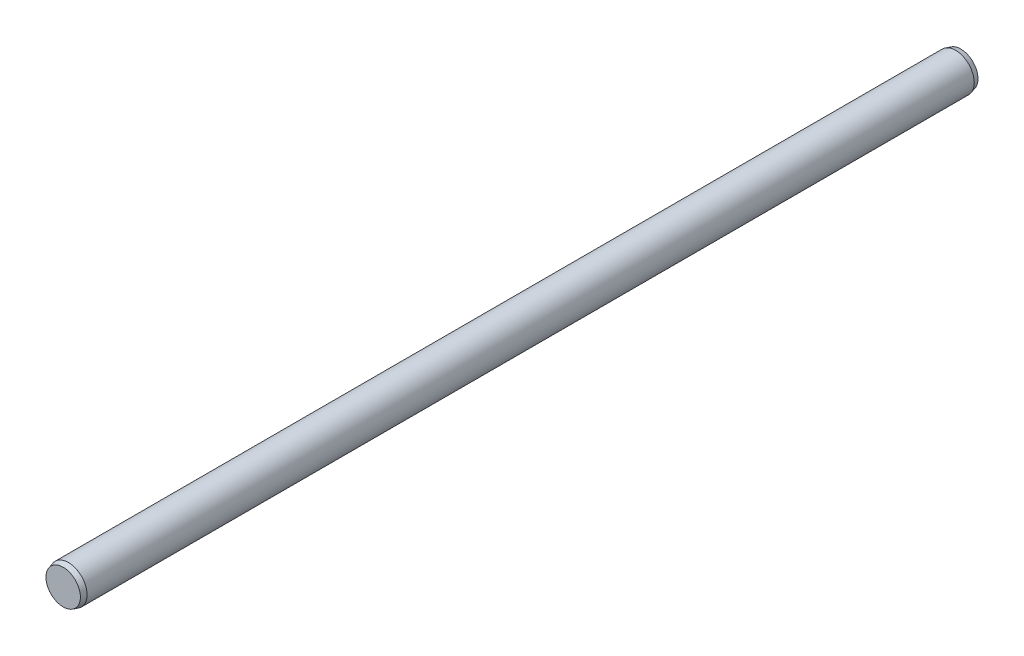
ISO-10303-21;
HEADER;
FILE_DESCRIPTION(('STEP AP214'),'2;1');
FILE_NAME('part.step','',(''),(''),'','','');
FILE_SCHEMA(('AUTOMOTIVE_DESIGN { 1 0 10303 214 1 1 1 1 }'));
ENDSEC;
DATA;
#1=APPLICATION_CONTEXT('core data for automotive mechanical design processes');
#2=APPLICATION_PROTOCOL_DEFINITION('international standard','automotive_design',2000,#1);
#3=PRODUCT_CONTEXT('',#1,'mechanical');
#4=PRODUCT('Part','Part','',(#3));
#5=PRODUCT_RELATED_PRODUCT_CATEGORY('part','',(#4));
#6=PRODUCT_DEFINITION_FORMATION('','',#4);
#7=PRODUCT_DEFINITION_CONTEXT('part definition',#1,'design');
#8=PRODUCT_DEFINITION('design','',#6,#7);
#9=PRODUCT_DEFINITION_SHAPE('','',#8);
#10=(LENGTH_UNIT() NAMED_UNIT(*) SI_UNIT(.MILLI.,.METRE.));
#11=(NAMED_UNIT(*) PLANE_ANGLE_UNIT() SI_UNIT($,.RADIAN.));
#12=(NAMED_UNIT(*) SI_UNIT($,.STERADIAN.) SOLID_ANGLE_UNIT());
#13=UNCERTAINTY_MEASURE_WITH_UNIT(LENGTH_MEASURE(1.E-05),#10,'distance_accuracy_value','');
#14=(GEOMETRIC_REPRESENTATION_CONTEXT(3) GLOBAL_UNCERTAINTY_ASSIGNED_CONTEXT((#13)) GLOBAL_UNIT_ASSIGNED_CONTEXT((#10,
#11,#12)) REPRESENTATION_CONTEXT('',''));
#15=CARTESIAN_POINT('',(0.,0.,0.));
#16=DIRECTION('',(0.,0.,1.));
#17=DIRECTION('',(1.,0.,0.));
#18=AXIS2_PLACEMENT_3D('',#15,#16,#17);
#19=CARTESIAN_POINT('',(0.,0.,76.2));
#20=DIRECTION('',(0.,0.,-1.));
#21=DIRECTION('',(-1.,0.,0.));
#22=AXIS2_PLACEMENT_3D('',#19,#20,#21);
#23=PLANE('',#22);
#24=CARTESIAN_POINT('',(0.,0.,76.2));
#25=DIRECTION('',(0.,0.,1.));
#26=DIRECTION('',(1.,0.,0.));
#27=AXIS2_PLACEMENT_3D('',#24,#25,#26);
#28=CIRCLE('',#27,2.921);
#29=CARTESIAN_POINT('',(2.921,0.,76.2));
#30=VERTEX_POINT('',#29);
#31=EDGE_CURVE('E10',#30,#30,#28,.T.);
#32=ORIENTED_EDGE('',*,*,#31,.T.);
#33=EDGE_LOOP('',(#32));
#34=FACE_BOUND('',#33,.T.);
#35=ADVANCED_FACE('F30',(#34),#23,.F.);
#36=CARTESIAN_POINT('',(0.,0.,75.3141967312644));
#37=DIRECTION('',(0.,0.,-1.));
#38=DIRECTION('',(-1.,0.,0.));
#39=AXIS2_PLACEMENT_3D('',#36,#37,#38);
#40=CONICAL_SURFACE('',#39,3.175,0.279252680319093);
#41=ORIENTED_EDGE('',*,*,#31,.F.);
#42=EDGE_LOOP('',(#41));
#43=FACE_BOUND('',#42,.T.);
#44=CARTESIAN_POINT('',(0.,0.,75.3141967312644));
#45=DIRECTION('',(0.,0.,1.));
#46=DIRECTION('',(1.,0.,0.));
#47=AXIS2_PLACEMENT_3D('',#44,#45,#46);
#48=CIRCLE('',#47,3.175);
#49=CARTESIAN_POINT('',(3.175,0.,75.3141967312644));
#50=VERTEX_POINT('',#49);
#51=EDGE_CURVE('E36',#50,#50,#48,.T.);
#52=ORIENTED_EDGE('',*,*,#51,.T.);
#53=EDGE_LOOP('',(#52));
#54=FACE_BOUND('',#53,.T.);
#55=ADVANCED_FACE('F62',(#43,#54),#40,.T.);
#56=CARTESIAN_POINT('',(0.,0.,76.2));
#57=DIRECTION('',(0.,0.,1.));
#58=DIRECTION('',(1.,0.,0.));
#59=AXIS2_PLACEMENT_3D('',#56,#57,#58);
#60=CYLINDRICAL_SURFACE('',#59,3.175);
#61=ORIENTED_EDGE('',*,*,#51,.F.);
#62=EDGE_LOOP('',(#61));
#63=FACE_BOUND('',#62,.T.);
#64=CARTESIAN_POINT('',(0.,0.,-75.3141967312644));
#65=DIRECTION('',(0.,0.,1.));
#66=DIRECTION('',(1.,0.,0.));
#67=AXIS2_PLACEMENT_3D('',#64,#65,#66);
#68=CIRCLE('',#67,3.175);
#69=CARTESIAN_POINT('',(3.175,0.,-75.3141967312644));
#70=VERTEX_POINT('',#69);
#71=EDGE_CURVE('E40',#70,#70,#68,.T.);
#72=ORIENTED_EDGE('',*,*,#71,.T.);
#73=EDGE_LOOP('',(#72));
#74=FACE_BOUND('',#73,.T.);
#75=ADVANCED_FACE('F58',(#63,#74),#60,.T.);
#76=CARTESIAN_POINT('',(0.,0.,-76.2));
#77=DIRECTION('',(0.,0.,1.));
#78=DIRECTION('',(1.,0.,0.));
#79=AXIS2_PLACEMENT_3D('',#76,#77,#78);
#80=CONICAL_SURFACE('',#79,2.921,0.279252680319097);
#81=ORIENTED_EDGE('',*,*,#71,.F.);
#82=EDGE_LOOP('',(#81));
#83=FACE_BOUND('',#82,.T.);
#84=CARTESIAN_POINT('',(0.,0.,-76.2));
#85=DIRECTION('',(0.,0.,1.));
#86=DIRECTION('',(1.,0.,0.));
#87=AXIS2_PLACEMENT_3D('',#84,#85,#86);
#88=CIRCLE('',#87,2.921);
#89=CARTESIAN_POINT('',(2.921,0.,-76.2));
#90=VERTEX_POINT('',#89);
#91=EDGE_CURVE('E44',#90,#90,#88,.T.);
#92=ORIENTED_EDGE('',*,*,#91,.T.);
#93=EDGE_LOOP('',(#92));
#94=FACE_BOUND('',#93,.T.);
#95=ADVANCED_FACE('F50',(#83,#94),#80,.T.);
#96=CARTESIAN_POINT('',(0.,2.921,-76.2));
#97=DIRECTION('',(0.,0.,1.));
#98=DIRECTION('',(1.,0.,0.));
#99=AXIS2_PLACEMENT_3D('',#96,#97,#98);
#100=PLANE('',#99);
#101=ORIENTED_EDGE('',*,*,#91,.F.);
#102=EDGE_LOOP('',(#101));
#103=FACE_BOUND('',#102,.T.);
#104=ADVANCED_FACE('F52',(#103),#100,.F.);
#105=CLOSED_SHELL('',(#35,#55,#75,#95,#104));
#106=MANIFOLD_SOLID_BREP('B2',#105);
#107=ADVANCED_BREP_SHAPE_REPRESENTATION('',(#18,#106),#14);
#108=SHAPE_DEFINITION_REPRESENTATION(#9,#107);
ENDSEC;
END-ISO-10303-21;
